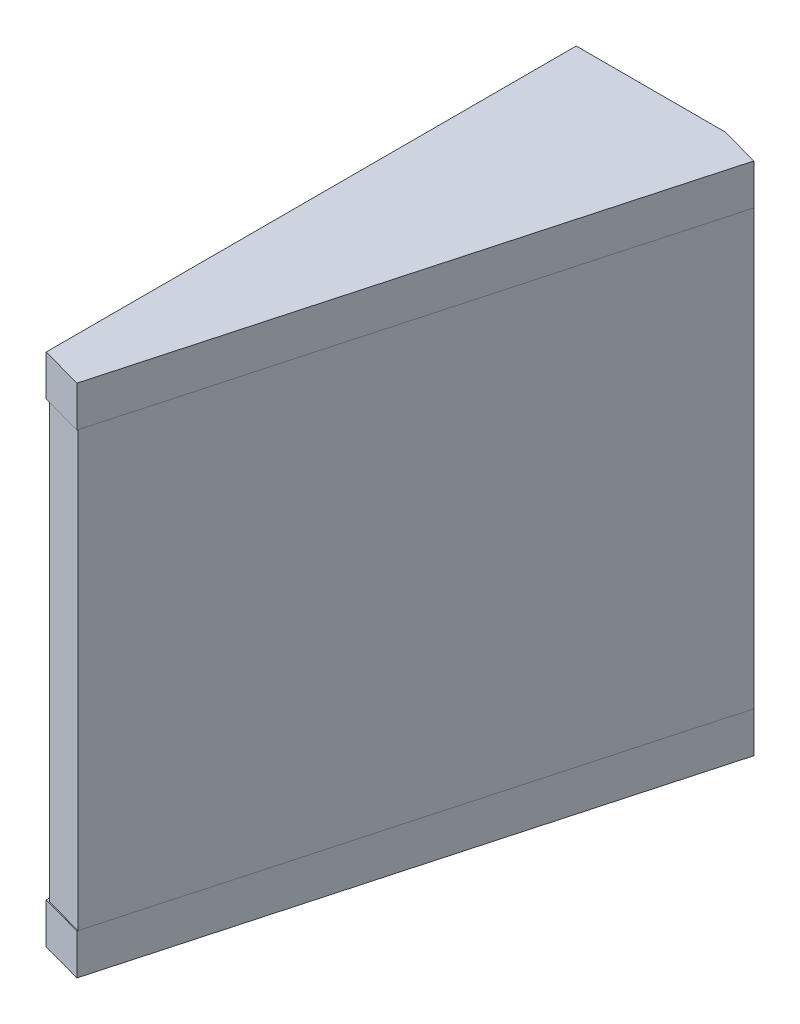
ISO-10303-21;
HEADER;
FILE_DESCRIPTION(('STEP AP214'),'2;1');
FILE_NAME('part.step','',(''),(''),'','','');
FILE_SCHEMA(('AUTOMOTIVE_DESIGN { 1 0 10303 214 1 1 1 1 }'));
ENDSEC;
DATA;
#1=APPLICATION_CONTEXT('core data for automotive mechanical design processes');
#2=APPLICATION_PROTOCOL_DEFINITION('international standard','automotive_design',2000,#1);
#3=PRODUCT_CONTEXT('',#1,'mechanical');
#4=PRODUCT('Part','Part','',(#3));
#5=PRODUCT_RELATED_PRODUCT_CATEGORY('part','',(#4));
#6=PRODUCT_DEFINITION_FORMATION('','',#4);
#7=PRODUCT_DEFINITION_CONTEXT('part definition',#1,'design');
#8=PRODUCT_DEFINITION('design','',#6,#7);
#9=PRODUCT_DEFINITION_SHAPE('','',#8);
#10=(LENGTH_UNIT() NAMED_UNIT(*) SI_UNIT(.MILLI.,.METRE.));
#11=(NAMED_UNIT(*) PLANE_ANGLE_UNIT() SI_UNIT($,.RADIAN.));
#12=(NAMED_UNIT(*) SI_UNIT($,.STERADIAN.) SOLID_ANGLE_UNIT());
#13=UNCERTAINTY_MEASURE_WITH_UNIT(LENGTH_MEASURE(1.E-05),#10,'distance_accuracy_value','');
#14=(GEOMETRIC_REPRESENTATION_CONTEXT(3) GLOBAL_UNCERTAINTY_ASSIGNED_CONTEXT((#13)) GLOBAL_UNIT_ASSIGNED_CONTEXT((#10,
#11,#12)) REPRESENTATION_CONTEXT('',''));
#15=CARTESIAN_POINT('',(0.,0.,0.));
#16=DIRECTION('',(0.,0.,1.));
#17=DIRECTION('',(1.,0.,0.));
#18=AXIS2_PLACEMENT_3D('',#15,#16,#17);
#19=CARTESIAN_POINT('',(8.35178299544795,52.012564609298,6.9060121898478));
#20=DIRECTION('',(0.96420539280379,0.,0.265156483021042));
#21=DIRECTION('',(0.265156483021042,0.,-0.96420539280379));
#22=AXIS2_PLACEMENT_3D('',#19,#20,#21);
#23=PLANE('',#22);
#24=DIRECTION('',(-0.265156483021042,0.,0.96420539280379));
#25=VECTOR('',#24,1.);
#26=CARTESIAN_POINT('',(8.35178299544795,49.012564609298,6.9060121898478));
#27=LINE('',#26,#25);
#28=CARTESIAN_POINT('',(8.35178299544795,49.012564609298,6.9060121898478));
#29=VERTEX_POINT('',#28);
#30=CARTESIAN_POINT('',(-2.41753086432374,49.012564609298,46.0671534981085));
#31=VERTEX_POINT('',#30);
#32=EDGE_CURVE('P0_E94',#29,#31,#27,.T.);
#33=ORIENTED_EDGE('',*,*,#32,.F.);
#34=DIRECTION('',(0.,-1.,0.));
#35=VECTOR('',#34,1.);
#36=CARTESIAN_POINT('',(8.35178299544795,52.012564609298,6.9060121898478));
#37=LINE('',#36,#35);
#38=CARTESIAN_POINT('',(8.35178299544795,52.012564609298,6.9060121898478));
#39=VERTEX_POINT('',#38);
#40=EDGE_CURVE('P0_E10',#39,#29,#37,.T.);
#41=ORIENTED_EDGE('',*,*,#40,.F.);
#42=DIRECTION('',(-0.265156483021042,0.,0.96420539280379));
#43=VECTOR('',#42,1.);
#44=CARTESIAN_POINT('',(8.35178299544795,52.012564609298,6.9060121898478));
#45=LINE('',#44,#43);
#46=CARTESIAN_POINT('',(-2.41753086432374,52.012564609298,46.0671534981085));
#47=VERTEX_POINT('',#46);
#48=EDGE_CURVE('P0_E89',#39,#47,#45,.T.);
#49=ORIENTED_EDGE('',*,*,#48,.T.);
#50=DIRECTION('',(0.,-1.,0.));
#51=VECTOR('',#50,1.);
#52=CARTESIAN_POINT('',(-2.41753086432374,52.012564609298,46.0671534981085));
#53=LINE('',#52,#51);
#54=EDGE_CURVE('P0_E19',#47,#31,#53,.T.);
#55=ORIENTED_EDGE('',*,*,#54,.T.);
#56=EDGE_LOOP('',(#33,#41,#49,#55));
#57=FACE_BOUND('',#56,.T.);
#58=ADVANCED_FACE('P0_F16',(#57),#23,.T.);
#59=CARTESIAN_POINT('',(8.35178299544795,52.012564609298,6.9060121898478));
#60=DIRECTION('',(-0.265156483021042,0.,0.96420539280379));
#61=DIRECTION('',(0.96420539280379,0.,0.265156483021042));
#62=AXIS2_PLACEMENT_3D('',#59,#60,#61);
#63=PLANE('',#62);
#64=DIRECTION('',(-0.96420539280379,0.,-0.265156483021042));
#65=VECTOR('',#64,1.);
#66=CARTESIAN_POINT('',(8.35178299544795,49.012564609298,6.9060121898478));
#67=LINE('',#66,#65);
#68=CARTESIAN_POINT('',(5.45916681703658,49.012564609298,6.11054274078467));
#69=VERTEX_POINT('',#68);
#70=EDGE_CURVE('P0_E103',#29,#69,#67,.T.);
#71=ORIENTED_EDGE('',*,*,#70,.T.);
#72=DIRECTION('',(0.,-1.,0.));
#73=VECTOR('',#72,1.);
#74=CARTESIAN_POINT('',(5.45916681703658,52.012564609298,6.11054274078467));
#75=LINE('',#74,#73);
#76=CARTESIAN_POINT('',(5.45916681703658,52.012564609298,6.11054274078467));
#77=VERTEX_POINT('',#76);
#78=EDGE_CURVE('P0_E25',#77,#69,#75,.T.);
#79=ORIENTED_EDGE('',*,*,#78,.F.);
#80=DIRECTION('',(-0.96420539280379,0.,-0.265156483021042));
#81=VECTOR('',#80,1.);
#82=CARTESIAN_POINT('',(8.35178299544795,52.012564609298,6.9060121898478));
#83=LINE('',#82,#81);
#84=EDGE_CURVE('P0_E84',#39,#77,#83,.T.);
#85=ORIENTED_EDGE('',*,*,#84,.F.);
#86=ORIENTED_EDGE('',*,*,#40,.T.);
#87=EDGE_LOOP('',(#71,#79,#85,#86));
#88=FACE_BOUND('',#87,.T.);
#89=ADVANCED_FACE('P0_F108',(#88),#63,.F.);
#90=CARTESIAN_POINT('',(-5.54083318296342,52.012564609298,6.11054274078467));
#91=DIRECTION('',(0.,0.,-1.));
#92=DIRECTION('',(-1.,0.,0.));
#93=AXIS2_PLACEMENT_3D('',#90,#91,#92);
#94=PLANE('',#93);
#95=DIRECTION('',(1.,0.,0.));
#96=VECTOR('',#95,1.);
#97=CARTESIAN_POINT('',(-5.54083318296342,49.012564609298,6.11054274078467));
#98=LINE('',#97,#96);
#99=CARTESIAN_POINT('',(-5.54083318296342,49.012564609298,6.11054274078467));
#100=VERTEX_POINT('',#99);
#101=EDGE_CURVE('P0_E72',#100,#69,#98,.T.);
#102=ORIENTED_EDGE('',*,*,#101,.F.);
#103=DIRECTION('',(0.,-1.,0.));
#104=VECTOR('',#103,1.);
#105=CARTESIAN_POINT('',(-5.54083318296342,52.012564609298,6.11054274078467));
#106=LINE('',#105,#104);
#107=CARTESIAN_POINT('',(-5.54083318296342,52.012564609298,6.11054274078467));
#108=VERTEX_POINT('',#107);
#109=EDGE_CURVE('P0_E67',#108,#100,#106,.T.);
#110=ORIENTED_EDGE('',*,*,#109,.F.);
#111=DIRECTION('',(1.,0.,0.));
#112=VECTOR('',#111,1.);
#113=CARTESIAN_POINT('',(-5.54083318296342,52.012564609298,6.11054274078467));
#114=LINE('',#113,#112);
#115=EDGE_CURVE('P0_E70',#108,#77,#114,.T.);
#116=ORIENTED_EDGE('',*,*,#115,.T.);
#117=ORIENTED_EDGE('',*,*,#78,.T.);
#118=EDGE_LOOP('',(#102,#110,#116,#117));
#119=FACE_BOUND('',#118,.T.);
#120=ADVANCED_FACE('P0_F69',(#119),#94,.T.);
#121=CARTESIAN_POINT('',(-5.54083318296342,52.012564609298,45.2082453604826));
#122=DIRECTION('',(-1.,0.,0.));
#123=DIRECTION('',(0.,0.,1.));
#124=AXIS2_PLACEMENT_3D('',#121,#122,#123);
#125=PLANE('',#124);
#126=DIRECTION('',(0.,0.,-1.));
#127=VECTOR('',#126,1.);
#128=CARTESIAN_POINT('',(-5.54083318296342,49.012564609298,45.2082453604826));
#129=LINE('',#128,#127);
#130=CARTESIAN_POINT('',(-5.54083318296342,49.012564609298,45.2082453604826));
#131=VERTEX_POINT('',#130);
#132=EDGE_CURVE('P0_E100',#131,#100,#129,.T.);
#133=ORIENTED_EDGE('',*,*,#132,.F.);
#134=DIRECTION('',(0.,-1.,0.));
#135=VECTOR('',#134,1.);
#136=CARTESIAN_POINT('',(-5.54083318296342,52.012564609298,45.2082453604826));
#137=LINE('',#136,#135);
#138=CARTESIAN_POINT('',(-5.54083318296342,52.012564609298,45.2082453604826));
#139=VERTEX_POINT('',#138);
#140=EDGE_CURVE('P0_E77',#139,#131,#137,.T.);
#141=ORIENTED_EDGE('',*,*,#140,.F.);
#142=DIRECTION('',(0.,0.,-1.));
#143=VECTOR('',#142,1.);
#144=CARTESIAN_POINT('',(-5.54083318296342,52.012564609298,45.2082453604826));
#145=LINE('',#144,#143);
#146=EDGE_CURVE('P0_E83',#139,#108,#145,.T.);
#147=ORIENTED_EDGE('',*,*,#146,.T.);
#148=ORIENTED_EDGE('',*,*,#109,.T.);
#149=EDGE_LOOP('',(#133,#141,#147,#148));
#150=FACE_BOUND('',#149,.T.);
#151=ADVANCED_FACE('P0_F86',(#150),#125,.T.);
#152=CARTESIAN_POINT('',(-2.41753086432374,52.012564609298,46.0671534981085));
#153=DIRECTION('',(-0.265156483021046,0.,0.964205392803789));
#154=DIRECTION('',(0.96420539280379,0.,0.265156483021046));
#155=AXIS2_PLACEMENT_3D('',#152,#153,#154);
#156=PLANE('',#155);
#157=DIRECTION('',(-0.964205392803789,0.,-0.265156483021046));
#158=VECTOR('',#157,1.);
#159=CARTESIAN_POINT('',(-2.41753086432374,49.012564609298,46.0671534981085));
#160=LINE('',#159,#158);
#161=EDGE_CURVE('P0_E97',#31,#131,#160,.T.);
#162=ORIENTED_EDGE('',*,*,#161,.F.);
#163=ORIENTED_EDGE('',*,*,#54,.F.);
#164=DIRECTION('',(-0.964205392803789,0.,-0.265156483021046));
#165=VECTOR('',#164,1.);
#166=CARTESIAN_POINT('',(-2.41753086432374,52.012564609298,46.0671534981085));
#167=LINE('',#166,#165);
#168=EDGE_CURVE('P0_E87',#47,#139,#167,.T.);
#169=ORIENTED_EDGE('',*,*,#168,.T.);
#170=ORIENTED_EDGE('',*,*,#140,.T.);
#171=EDGE_LOOP('',(#162,#163,#169,#170));
#172=FACE_BOUND('',#171,.T.);
#173=ADVANCED_FACE('P0_F105',(#172),#156,.T.);
#174=CARTESIAN_POINT('',(-5.54083318296342,52.012564609298,46.1105427407847));
#175=DIRECTION('',(0.,-1.,0.));
#176=DIRECTION('',(0.,0.,-1.));
#177=AXIS2_PLACEMENT_3D('',#174,#175,#176);
#178=PLANE('',#177);
#179=ORIENTED_EDGE('',*,*,#48,.F.);
#180=ORIENTED_EDGE('',*,*,#84,.T.);
#181=ORIENTED_EDGE('',*,*,#115,.F.);
#182=ORIENTED_EDGE('',*,*,#146,.F.);
#183=ORIENTED_EDGE('',*,*,#168,.F.);
#184=EDGE_LOOP('',(#179,#180,#181,#182,#183));
#185=FACE_BOUND('',#184,.T.);
#186=ADVANCED_FACE('P0_F82',(#185),#178,.F.);
#187=CARTESIAN_POINT('',(-5.54083318296342,49.012564609298,46.1105427407847));
#188=DIRECTION('',(0.,-1.,0.));
#189=DIRECTION('',(0.,0.,-1.));
#190=AXIS2_PLACEMENT_3D('',#187,#188,#189);
#191=PLANE('',#190);
#192=ORIENTED_EDGE('',*,*,#32,.T.);
#193=ORIENTED_EDGE('',*,*,#161,.T.);
#194=ORIENTED_EDGE('',*,*,#132,.T.);
#195=ORIENTED_EDGE('',*,*,#101,.T.);
#196=ORIENTED_EDGE('',*,*,#70,.F.);
#197=EDGE_LOOP('',(#192,#193,#194,#195,#196));
#198=FACE_BOUND('',#197,.T.);
#199=ADVANCED_FACE('P0_F107',(#198),#191,.T.);
#200=CLOSED_SHELL('',(#58,#89,#120,#151,#173,#186,#199));
#201=MANIFOLD_SOLID_BREP('P0_B1',#200);
#202=CARTESIAN_POINT('',(-5.29292856946668,17.012564609298,45.2090714189784));
#203=DIRECTION('',(0.,1.,0.));
#204=DIRECTION('',(0.964205392803791,0.,0.265156483021042));
#205=AXIS2_PLACEMENT_3D('',#202,#203,#204);
#206=PLANE('',#205);
#207=DIRECTION('',(-0.265156483021042,0.,0.964205392803791));
#208=VECTOR('',#207,1.);
#209=CARTESIAN_POINT('',(-2.40031239105531,17.012564609298,46.0045408680415));
#210=LINE('',#209,#208);
#211=CARTESIAN_POINT('',(8.35178299544795,17.012564609298,6.9060121898478));
#212=VERTEX_POINT('',#211);
#213=CARTESIAN_POINT('',(-2.40031239105531,17.012564609298,46.0045408680415));
#214=VERTEX_POINT('',#213);
#215=EDGE_CURVE('P1_E80',#212,#214,#210,.T.);
#216=ORIENTED_EDGE('',*,*,#215,.T.);
#217=DIRECTION('',(0.964205392803791,0.,0.265156483021042));
#218=VECTOR('',#217,1.);
#219=CARTESIAN_POINT('',(-5.29292856946668,17.012564609298,45.2090714189784));
#220=LINE('',#219,#218);
#221=CARTESIAN_POINT('',(-5.29292856946668,17.012564609298,45.2090714189784));
#222=VERTEX_POINT('',#221);
#223=EDGE_CURVE('P1_E11',#222,#214,#220,.T.);
#224=ORIENTED_EDGE('',*,*,#223,.F.);
#225=DIRECTION('',(-0.265156483021042,0.,0.964205392803791));
#226=VECTOR('',#225,1.);
#227=CARTESIAN_POINT('',(-5.29292856946668,17.012564609298,45.2090714189784));
#228=LINE('',#227,#226);
#229=CARTESIAN_POINT('',(5.45916681703658,17.012564609298,6.11054274078467));
#230=VERTEX_POINT('',#229);
#231=EDGE_CURVE('P1_E68',#230,#222,#228,.T.);
#232=ORIENTED_EDGE('',*,*,#231,.F.);
#233=DIRECTION('',(0.964205392803791,0.,0.265156483021042));
#234=VECTOR('',#233,1.);
#235=CARTESIAN_POINT('',(5.45916681703658,17.012564609298,6.11054274078467));
#236=LINE('',#235,#234);
#237=EDGE_CURVE('P1_E76',#230,#212,#236,.T.);
#238=ORIENTED_EDGE('',*,*,#237,.T.);
#239=EDGE_LOOP('',(#216,#224,#232,#238));
#240=FACE_BOUND('',#239,.T.);
#241=ADVANCED_FACE('P1_F17',(#240),#206,.F.);
#242=CARTESIAN_POINT('',(-5.29292856946668,17.012564609298,45.2090714189784));
#243=DIRECTION('',(0.265156483021042,0.,-0.964205392803791));
#244=DIRECTION('',(-0.964205392803791,0.,-0.265156483021042));
#245=AXIS2_PLACEMENT_3D('',#242,#243,#244);
#246=PLANE('',#245);
#247=DIRECTION('',(0.,1.,0.));
#248=VECTOR('',#247,1.);
#249=CARTESIAN_POINT('',(-2.40031239105531,17.012564609298,46.0045408680415));
#250=LINE('',#249,#248);
#251=CARTESIAN_POINT('',(-2.40031239105531,49.012564609298,46.0045408680415));
#252=VERTEX_POINT('',#251);
#253=EDGE_CURVE('P1_E72',#214,#252,#250,.T.);
#254=ORIENTED_EDGE('',*,*,#253,.T.);
#255=DIRECTION('',(0.964205392803791,0.,0.265156483021042));
#256=VECTOR('',#255,1.);
#257=CARTESIAN_POINT('',(-5.29292856946668,49.012564609298,45.2090714189784));
#258=LINE('',#257,#256);
#259=CARTESIAN_POINT('',(-5.29292856946668,49.012564609298,45.2090714189784));
#260=VERTEX_POINT('',#259);
#261=EDGE_CURVE('P1_E25',#260,#252,#258,.T.);
#262=ORIENTED_EDGE('',*,*,#261,.F.);
#263=DIRECTION('',(0.,1.,0.));
#264=VECTOR('',#263,1.);
#265=CARTESIAN_POINT('',(-5.29292856946668,17.012564609298,45.2090714189784));
#266=LINE('',#265,#264);
#267=EDGE_CURVE('P1_E63',#222,#260,#266,.T.);
#268=ORIENTED_EDGE('',*,*,#267,.F.);
#269=ORIENTED_EDGE('',*,*,#223,.T.);
#270=EDGE_LOOP('',(#254,#262,#268,#269));
#271=FACE_BOUND('',#270,.T.);
#272=ADVANCED_FACE('P1_F71',(#271),#246,.F.);
#273=CARTESIAN_POINT('',(-5.29292856946668,49.012564609298,45.2090714189784));
#274=DIRECTION('',(0.,-1.,0.));
#275=DIRECTION('',(-0.265156483021042,0.,0.964205392803791));
#276=AXIS2_PLACEMENT_3D('',#273,#274,#275);
#277=PLANE('',#276);
#278=DIRECTION('',(0.265156483021042,0.,-0.964205392803791));
#279=VECTOR('',#278,1.);
#280=CARTESIAN_POINT('',(-2.40031239105531,49.012564609298,46.0045408680415));
#281=LINE('',#280,#279);
#282=CARTESIAN_POINT('',(8.35178299544795,49.012564609298,6.9060121898478));
#283=VERTEX_POINT('',#282);
#284=EDGE_CURVE('P1_E50',#252,#283,#281,.T.);
#285=ORIENTED_EDGE('',*,*,#284,.T.);
#286=DIRECTION('',(0.964205392803791,0.,0.265156483021042));
#287=VECTOR('',#286,1.);
#288=CARTESIAN_POINT('',(5.45916681703658,49.012564609298,6.11054274078467));
#289=LINE('',#288,#287);
#290=CARTESIAN_POINT('',(5.45916681703658,49.012564609298,6.11054274078467));
#291=VERTEX_POINT('',#290);
#292=EDGE_CURVE('P1_E73',#291,#283,#289,.T.);
#293=ORIENTED_EDGE('',*,*,#292,.F.);
#294=DIRECTION('',(0.265156483021042,0.,-0.964205392803791));
#295=VECTOR('',#294,1.);
#296=CARTESIAN_POINT('',(-5.29292856946668,49.012564609298,45.2090714189784));
#297=LINE('',#296,#295);
#298=EDGE_CURVE('P1_E66',#260,#291,#297,.T.);
#299=ORIENTED_EDGE('',*,*,#298,.F.);
#300=ORIENTED_EDGE('',*,*,#261,.T.);
#301=EDGE_LOOP('',(#285,#293,#299,#300));
#302=FACE_BOUND('',#301,.T.);
#303=ADVANCED_FACE('P1_F74',(#302),#277,.F.);
#304=CARTESIAN_POINT('',(5.45916681703658,17.012564609298,6.11054274078467));
#305=DIRECTION('',(-0.265156483021042,0.,0.964205392803791));
#306=DIRECTION('',(0.964205392803791,0.,0.265156483021042));
#307=AXIS2_PLACEMENT_3D('',#304,#305,#306);
#308=PLANE('',#307);
#309=DIRECTION('',(0.,-1.,0.));
#310=VECTOR('',#309,1.);
#311=CARTESIAN_POINT('',(8.35178299544795,17.012564609298,6.9060121898478));
#312=LINE('',#311,#310);
#313=EDGE_CURVE('P1_E56',#283,#212,#312,.T.);
#314=ORIENTED_EDGE('',*,*,#313,.T.);
#315=ORIENTED_EDGE('',*,*,#237,.F.);
#316=DIRECTION('',(0.,-1.,0.));
#317=VECTOR('',#316,1.);
#318=CARTESIAN_POINT('',(5.45916681703658,17.012564609298,6.11054274078467));
#319=LINE('',#318,#317);
#320=EDGE_CURVE('P1_E33',#291,#230,#319,.T.);
#321=ORIENTED_EDGE('',*,*,#320,.F.);
#322=ORIENTED_EDGE('',*,*,#292,.T.);
#323=EDGE_LOOP('',(#314,#315,#321,#322));
#324=FACE_BOUND('',#323,.T.);
#325=ADVANCED_FACE('P1_F87',(#324),#308,.F.);
#326=CARTESIAN_POINT('',(-5.29292856946668,17.012564609298,45.2090714189784));
#327=DIRECTION('',(0.964205392803791,0.,0.265156483021042));
#328=DIRECTION('',(0.,-1.,0.));
#329=AXIS2_PLACEMENT_3D('',#326,#327,#328);
#330=PLANE('',#329);
#331=ORIENTED_EDGE('',*,*,#231,.T.);
#332=ORIENTED_EDGE('',*,*,#267,.T.);
#333=ORIENTED_EDGE('',*,*,#298,.T.);
#334=ORIENTED_EDGE('',*,*,#320,.T.);
#335=EDGE_LOOP('',(#331,#332,#333,#334));
#336=FACE_BOUND('',#335,.T.);
#337=ADVANCED_FACE('P1_F64',(#336),#330,.F.);
#338=CARTESIAN_POINT('',(-2.40031239105531,17.012564609298,46.0045408680415));
#339=DIRECTION('',(0.964205392803791,0.,0.265156483021042));
#340=DIRECTION('',(0.,-1.,0.));
#341=AXIS2_PLACEMENT_3D('',#338,#339,#340);
#342=PLANE('',#341);
#343=ORIENTED_EDGE('',*,*,#215,.F.);
#344=ORIENTED_EDGE('',*,*,#313,.F.);
#345=ORIENTED_EDGE('',*,*,#284,.F.);
#346=ORIENTED_EDGE('',*,*,#253,.F.);
#347=EDGE_LOOP('',(#343,#344,#345,#346));
#348=FACE_BOUND('',#347,.T.);
#349=ADVANCED_FACE('P1_F90',(#348),#342,.T.);
#350=CLOSED_SHELL('',(#241,#272,#303,#325,#337,#349));
#351=MANIFOLD_SOLID_BREP('P1_B1',#350);
#352=CARTESIAN_POINT('',(8.35178299544795,17.012564609298,6.9060121898478));
#353=DIRECTION('',(0.96420539280379,0.,0.265156483021042));
#354=DIRECTION('',(0.265156483021042,0.,-0.96420539280379));
#355=AXIS2_PLACEMENT_3D('',#352,#353,#354);
#356=PLANE('',#355);
#357=DIRECTION('',(-0.265156483021042,0.,0.96420539280379));
#358=VECTOR('',#357,1.);
#359=CARTESIAN_POINT('',(8.35178299544795,14.012564609298,6.9060121898478));
#360=LINE('',#359,#358);
#361=CARTESIAN_POINT('',(8.35178299544795,14.012564609298,6.9060121898478));
#362=VERTEX_POINT('',#361);
#363=CARTESIAN_POINT('',(-2.41753086432373,14.012564609298,46.0671534981085));
#364=VERTEX_POINT('',#363);
#365=EDGE_CURVE('P2_E95',#362,#364,#360,.T.);
#366=ORIENTED_EDGE('',*,*,#365,.F.);
#367=DIRECTION('',(0.,-1.,0.));
#368=VECTOR('',#367,1.);
#369=CARTESIAN_POINT('',(8.35178299544795,17.012564609298,6.9060121898478));
#370=LINE('',#369,#368);
#371=CARTESIAN_POINT('',(8.35178299544795,17.012564609298,6.9060121898478));
#372=VERTEX_POINT('',#371);
#373=EDGE_CURVE('P2_E11',#372,#362,#370,.T.);
#374=ORIENTED_EDGE('',*,*,#373,.F.);
#375=DIRECTION('',(-0.265156483021042,0.,0.96420539280379));
#376=VECTOR('',#375,1.);
#377=CARTESIAN_POINT('',(8.35178299544795,17.012564609298,6.9060121898478));
#378=LINE('',#377,#376);
#379=CARTESIAN_POINT('',(-2.41753086432373,17.012564609298,46.0671534981085));
#380=VERTEX_POINT('',#379);
#381=EDGE_CURVE('P2_E90',#372,#380,#378,.T.);
#382=ORIENTED_EDGE('',*,*,#381,.T.);
#383=DIRECTION('',(0.,-1.,0.));
#384=VECTOR('',#383,1.);
#385=CARTESIAN_POINT('',(-2.41753086432373,17.012564609298,46.0671534981085));
#386=LINE('',#385,#384);
#387=EDGE_CURVE('P2_E20',#380,#364,#386,.T.);
#388=ORIENTED_EDGE('',*,*,#387,.T.);
#389=EDGE_LOOP('',(#366,#374,#382,#388));
#390=FACE_BOUND('',#389,.T.);
#391=ADVANCED_FACE('P2_F17',(#390),#356,.T.);
#392=CARTESIAN_POINT('',(8.35178299544795,17.012564609298,6.9060121898478));
#393=DIRECTION('',(-0.265156483021042,0.,0.96420539280379));
#394=DIRECTION('',(0.96420539280379,0.,0.265156483021042));
#395=AXIS2_PLACEMENT_3D('',#392,#393,#394);
#396=PLANE('',#395);
#397=DIRECTION('',(-0.96420539280379,0.,-0.265156483021042));
#398=VECTOR('',#397,1.);
#399=CARTESIAN_POINT('',(8.35178299544795,14.012564609298,6.9060121898478));
#400=LINE('',#399,#398);
#401=CARTESIAN_POINT('',(5.45916681703658,14.012564609298,6.11054274078467));
#402=VERTEX_POINT('',#401);
#403=EDGE_CURVE('P2_E104',#362,#402,#400,.T.);
#404=ORIENTED_EDGE('',*,*,#403,.T.);
#405=DIRECTION('',(0.,-1.,0.));
#406=VECTOR('',#405,1.);
#407=CARTESIAN_POINT('',(5.45916681703658,17.012564609298,6.11054274078467));
#408=LINE('',#407,#406);
#409=CARTESIAN_POINT('',(5.45916681703658,17.012564609298,6.11054274078467));
#410=VERTEX_POINT('',#409);
#411=EDGE_CURVE('P2_E26',#410,#402,#408,.T.);
#412=ORIENTED_EDGE('',*,*,#411,.F.);
#413=DIRECTION('',(-0.96420539280379,0.,-0.265156483021042));
#414=VECTOR('',#413,1.);
#415=CARTESIAN_POINT('',(8.35178299544795,17.012564609298,6.9060121898478));
#416=LINE('',#415,#414);
#417=EDGE_CURVE('P2_E85',#372,#410,#416,.T.);
#418=ORIENTED_EDGE('',*,*,#417,.F.);
#419=ORIENTED_EDGE('',*,*,#373,.T.);
#420=EDGE_LOOP('',(#404,#412,#418,#419));
#421=FACE_BOUND('',#420,.T.);
#422=ADVANCED_FACE('P2_F109',(#421),#396,.F.);
#423=CARTESIAN_POINT('',(-5.54083318296342,17.012564609298,6.11054274078467));
#424=DIRECTION('',(0.,0.,-1.));
#425=DIRECTION('',(-1.,0.,0.));
#426=AXIS2_PLACEMENT_3D('',#423,#424,#425);
#427=PLANE('',#426);
#428=DIRECTION('',(1.,0.,0.));
#429=VECTOR('',#428,1.);
#430=CARTESIAN_POINT('',(-5.54083318296342,14.012564609298,6.11054274078467));
#431=LINE('',#430,#429);
#432=CARTESIAN_POINT('',(-5.54083318296342,14.012564609298,6.11054274078467));
#433=VERTEX_POINT('',#432);
#434=EDGE_CURVE('P2_E73',#433,#402,#431,.T.);
#435=ORIENTED_EDGE('',*,*,#434,.F.);
#436=DIRECTION('',(0.,-1.,0.));
#437=VECTOR('',#436,1.);
#438=CARTESIAN_POINT('',(-5.54083318296342,17.012564609298,6.11054274078467));
#439=LINE('',#438,#437);
#440=CARTESIAN_POINT('',(-5.54083318296342,17.012564609298,6.11054274078467));
#441=VERTEX_POINT('',#440);
#442=EDGE_CURVE('P2_E68',#441,#433,#439,.T.);
#443=ORIENTED_EDGE('',*,*,#442,.F.);
#444=DIRECTION('',(1.,0.,0.));
#445=VECTOR('',#444,1.);
#446=CARTESIAN_POINT('',(-5.54083318296342,17.012564609298,6.11054274078467));
#447=LINE('',#446,#445);
#448=EDGE_CURVE('P2_E71',#441,#410,#447,.T.);
#449=ORIENTED_EDGE('',*,*,#448,.T.);
#450=ORIENTED_EDGE('',*,*,#411,.T.);
#451=EDGE_LOOP('',(#435,#443,#449,#450));
#452=FACE_BOUND('',#451,.T.);
#453=ADVANCED_FACE('P2_F70',(#452),#427,.T.);
#454=CARTESIAN_POINT('',(-5.54083318296342,17.012564609298,45.2082453604826));
#455=DIRECTION('',(-1.,0.,0.));
#456=DIRECTION('',(0.,0.,1.));
#457=AXIS2_PLACEMENT_3D('',#454,#455,#456);
#458=PLANE('',#457);
#459=DIRECTION('',(0.,0.,-1.));
#460=VECTOR('',#459,1.);
#461=CARTESIAN_POINT('',(-5.54083318296342,14.012564609298,45.2082453604826));
#462=LINE('',#461,#460);
#463=CARTESIAN_POINT('',(-5.54083318296342,14.012564609298,45.2082453604826));
#464=VERTEX_POINT('',#463);
#465=EDGE_CURVE('P2_E101',#464,#433,#462,.T.);
#466=ORIENTED_EDGE('',*,*,#465,.F.);
#467=DIRECTION('',(0.,-1.,0.));
#468=VECTOR('',#467,1.);
#469=CARTESIAN_POINT('',(-5.54083318296342,17.012564609298,45.2082453604826));
#470=LINE('',#469,#468);
#471=CARTESIAN_POINT('',(-5.54083318296342,17.012564609298,45.2082453604826));
#472=VERTEX_POINT('',#471);
#473=EDGE_CURVE('P2_E78',#472,#464,#470,.T.);
#474=ORIENTED_EDGE('',*,*,#473,.F.);
#475=DIRECTION('',(0.,0.,-1.));
#476=VECTOR('',#475,1.);
#477=CARTESIAN_POINT('',(-5.54083318296342,17.012564609298,45.2082453604826));
#478=LINE('',#477,#476);
#479=EDGE_CURVE('P2_E84',#472,#441,#478,.T.);
#480=ORIENTED_EDGE('',*,*,#479,.T.);
#481=ORIENTED_EDGE('',*,*,#442,.T.);
#482=EDGE_LOOP('',(#466,#474,#480,#481));
#483=FACE_BOUND('',#482,.T.);
#484=ADVANCED_FACE('P2_F87',(#483),#458,.T.);
#485=CARTESIAN_POINT('',(-2.41753086432373,17.012564609298,46.0671534981085));
#486=DIRECTION('',(-0.265156483021046,0.,0.964205392803789));
#487=DIRECTION('',(0.96420539280379,0.,0.265156483021046));
#488=AXIS2_PLACEMENT_3D('',#485,#486,#487);
#489=PLANE('',#488);
#490=DIRECTION('',(-0.964205392803789,0.,-0.265156483021046));
#491=VECTOR('',#490,1.);
#492=CARTESIAN_POINT('',(-2.41753086432373,14.012564609298,46.0671534981085));
#493=LINE('',#492,#491);
#494=EDGE_CURVE('P2_E98',#364,#464,#493,.T.);
#495=ORIENTED_EDGE('',*,*,#494,.F.);
#496=ORIENTED_EDGE('',*,*,#387,.F.);
#497=DIRECTION('',(-0.964205392803789,0.,-0.265156483021046));
#498=VECTOR('',#497,1.);
#499=CARTESIAN_POINT('',(-2.41753086432373,17.012564609298,46.0671534981085));
#500=LINE('',#499,#498);
#501=EDGE_CURVE('P2_E88',#380,#472,#500,.T.);
#502=ORIENTED_EDGE('',*,*,#501,.T.);
#503=ORIENTED_EDGE('',*,*,#473,.T.);
#504=EDGE_LOOP('',(#495,#496,#502,#503));
#505=FACE_BOUND('',#504,.T.);
#506=ADVANCED_FACE('P2_F106',(#505),#489,.T.);
#507=CARTESIAN_POINT('',(-5.54083318296342,17.012564609298,46.1105427407847));
#508=DIRECTION('',(0.,-1.,0.));
#509=DIRECTION('',(0.,0.,-1.));
#510=AXIS2_PLACEMENT_3D('',#507,#508,#509);
#511=PLANE('',#510);
#512=ORIENTED_EDGE('',*,*,#381,.F.);
#513=ORIENTED_EDGE('',*,*,#417,.T.);
#514=ORIENTED_EDGE('',*,*,#448,.F.);
#515=ORIENTED_EDGE('',*,*,#479,.F.);
#516=ORIENTED_EDGE('',*,*,#501,.F.);
#517=EDGE_LOOP('',(#512,#513,#514,#515,#516));
#518=FACE_BOUND('',#517,.T.);
#519=ADVANCED_FACE('P2_F83',(#518),#511,.F.);
#520=CARTESIAN_POINT('',(-5.54083318296342,14.012564609298,46.1105427407847));
#521=DIRECTION('',(0.,-1.,0.));
#522=DIRECTION('',(0.,0.,-1.));
#523=AXIS2_PLACEMENT_3D('',#520,#521,#522);
#524=PLANE('',#523);
#525=ORIENTED_EDGE('',*,*,#365,.T.);
#526=ORIENTED_EDGE('',*,*,#494,.T.);
#527=ORIENTED_EDGE('',*,*,#465,.T.);
#528=ORIENTED_EDGE('',*,*,#434,.T.);
#529=ORIENTED_EDGE('',*,*,#403,.F.);
#530=EDGE_LOOP('',(#525,#526,#527,#528,#529));
#531=FACE_BOUND('',#530,.T.);
#532=ADVANCED_FACE('P2_F108',(#531),#524,.T.);
#533=CLOSED_SHELL('',(#391,#422,#453,#484,#506,#519,#532));
#534=MANIFOLD_SOLID_BREP('P2_B1',#533);
#535=ADVANCED_BREP_SHAPE_REPRESENTATION('',(#18,#201,#351,#534),#14);
#536=SHAPE_DEFINITION_REPRESENTATION(#9,#535);
ENDSEC;
END-ISO-10303-21;
